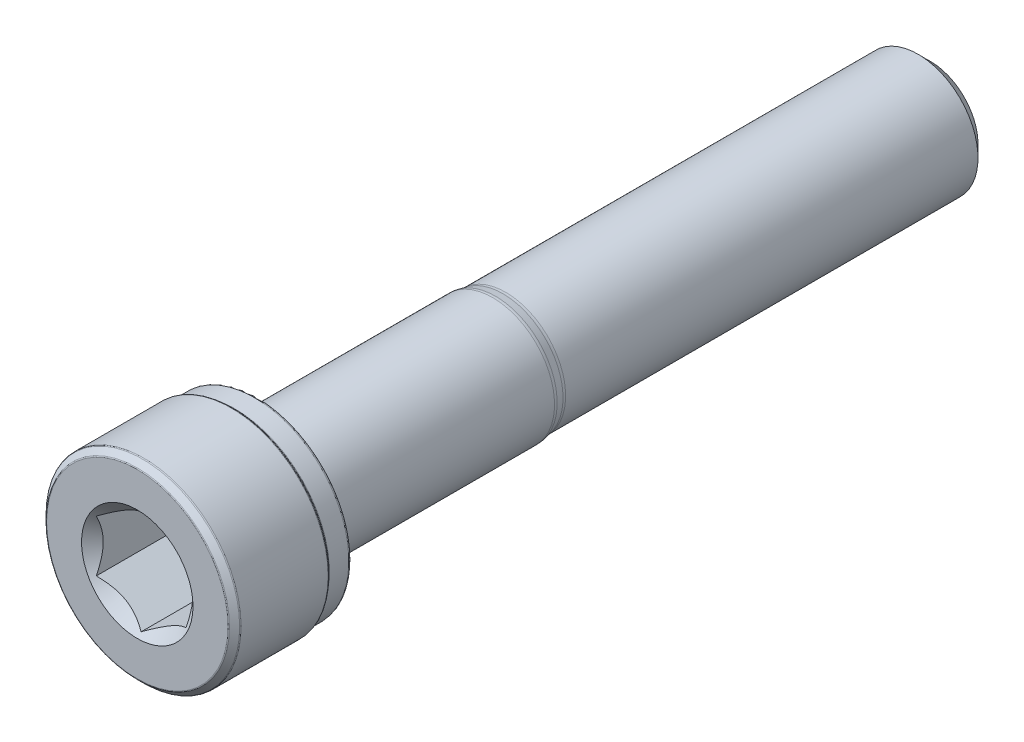
ISO-10303-21;
HEADER;
FILE_DESCRIPTION(('STEP AP214'),'2;1');
FILE_NAME('part.step','',(''),(''),'','','');
FILE_SCHEMA(('AUTOMOTIVE_DESIGN { 1 0 10303 214 1 1 1 1 }'));
ENDSEC;
DATA;
#1=APPLICATION_CONTEXT('core data for automotive mechanical design processes');
#2=APPLICATION_PROTOCOL_DEFINITION('international standard','automotive_design',2000,#1);
#3=PRODUCT_CONTEXT('',#1,'mechanical');
#4=PRODUCT('Part','Part','',(#3));
#5=PRODUCT_RELATED_PRODUCT_CATEGORY('part','',(#4));
#6=PRODUCT_DEFINITION_FORMATION('','',#4);
#7=PRODUCT_DEFINITION_CONTEXT('part definition',#1,'design');
#8=PRODUCT_DEFINITION('design','',#6,#7);
#9=PRODUCT_DEFINITION_SHAPE('','',#8);
#10=(LENGTH_UNIT() NAMED_UNIT(*) SI_UNIT(.MILLI.,.METRE.));
#11=(NAMED_UNIT(*) PLANE_ANGLE_UNIT() SI_UNIT($,.RADIAN.));
#12=(NAMED_UNIT(*) SI_UNIT($,.STERADIAN.) SOLID_ANGLE_UNIT());
#13=UNCERTAINTY_MEASURE_WITH_UNIT(LENGTH_MEASURE(1.E-05),#10,'distance_accuracy_value','');
#14=(GEOMETRIC_REPRESENTATION_CONTEXT(3) GLOBAL_UNCERTAINTY_ASSIGNED_CONTEXT((#13)) GLOBAL_UNIT_ASSIGNED_CONTEXT((#10,
#11,#12)) REPRESENTATION_CONTEXT('',''));
#15=CARTESIAN_POINT('',(0.,0.,0.));
#16=DIRECTION('',(0.,0.,1.));
#17=DIRECTION('',(1.,0.,0.));
#18=AXIS2_PLACEMENT_3D('',#15,#16,#17);
#19=CARTESIAN_POINT('',(0.,3.18810118395208,-26.5));
#20=DIRECTION('',(0.,0.,-1.));
#21=DIRECTION('',(-1.,0.,0.));
#22=AXIS2_PLACEMENT_3D('',#19,#20,#21);
#23=PLANE('',#22);
#24=CARTESIAN_POINT('',(0.,0.,-26.5));
#25=DIRECTION('',(0.,0.,-1.));
#26=DIRECTION('',(-1.,0.,0.));
#27=AXIS2_PLACEMENT_3D('',#24,#25,#26);
#28=CIRCLE('',#27,3.18810118395208);
#29=CARTESIAN_POINT('',(-3.18810118395208,0.,-26.5));
#30=VERTEX_POINT('',#29);
#31=EDGE_CURVE('E49',#30,#30,#28,.T.);
#32=ORIENTED_EDGE('',*,*,#31,.T.);
#33=EDGE_LOOP('',(#32));
#34=FACE_BOUND('',#33,.T.);
#35=ADVANCED_FACE('F36',(#34),#23,.T.);
#36=CARTESIAN_POINT('',(0.,0.,-26.5));
#37=DIRECTION('',(0.,0.,1.));
#38=DIRECTION('',(1.,0.,0.));
#39=AXIS2_PLACEMENT_3D('',#36,#37,#38);
#40=CONICAL_SURFACE('',#39,3.18810118395208,0.785398163397442);
#41=CARTESIAN_POINT('',(0.,0.,-25.6881011839521));
#42=DIRECTION('',(0.,0.,-1.));
#43=DIRECTION('',(-1.,0.,0.));
#44=AXIS2_PLACEMENT_3D('',#41,#42,#43);
#45=CIRCLE('',#44,4.);
#46=CARTESIAN_POINT('',(-4.,0.,-25.6881011839521));
#47=VERTEX_POINT('',#46);
#48=EDGE_CURVE('E182',#47,#47,#45,.T.);
#49=ORIENTED_EDGE('',*,*,#48,.T.);
#50=EDGE_LOOP('',(#49));
#51=FACE_BOUND('',#50,.T.);
#52=ORIENTED_EDGE('',*,*,#31,.F.);
#53=EDGE_LOOP('',(#52));
#54=FACE_BOUND('',#53,.T.);
#55=ADVANCED_FACE('F188',(#51,#54),#40,.T.);
#56=CARTESIAN_POINT('',(0.,0.,-26.5));
#57=DIRECTION('',(0.,0.,-1.));
#58=DIRECTION('',(-1.,0.,0.));
#59=AXIS2_PLACEMENT_3D('',#56,#57,#58);
#60=CYLINDRICAL_SURFACE('',#59,4.);
#61=CARTESIAN_POINT('',(0.,0.,1.87025859664283));
#62=DIRECTION('',(0.,0.,-1.));
#63=DIRECTION('',(-1.,0.,0.));
#64=AXIS2_PLACEMENT_3D('',#61,#62,#63);
#65=CIRCLE('',#64,4.);
#66=CARTESIAN_POINT('',(-4.,0.,1.87025859664283));
#67=VERTEX_POINT('',#66);
#68=EDGE_CURVE('E179',#67,#67,#65,.T.);
#69=ORIENTED_EDGE('',*,*,#68,.T.);
#70=EDGE_LOOP('',(#69));
#71=FACE_BOUND('',#70,.T.);
#72=ORIENTED_EDGE('',*,*,#48,.F.);
#73=EDGE_LOOP('',(#72));
#74=FACE_BOUND('',#73,.T.);
#75=ADVANCED_FACE('F190',(#71,#74),#60,.T.);
#76=CARTESIAN_POINT('',(0.,0.,1.87025859664283));
#77=DIRECTION('',(0.,0.,-1.));
#78=DIRECTION('',(-1.,0.,0.));
#79=AXIS2_PLACEMENT_3D('',#76,#77,#78);
#80=TOROIDAL_SURFACE('',#79,5.,1.);
#81=CARTESIAN_POINT('',(0.,0.,2.06534891865896));
#82=DIRECTION('',(0.,0.,-1.));
#83=DIRECTION('',(-1.,0.,0.));
#84=AXIS2_PLACEMENT_3D('',#81,#82,#83);
#85=CIRCLE('',#84,4.01921471959677);
#86=CARTESIAN_POINT('',(-4.01921471959677,0.,2.06534891865896));
#87=VERTEX_POINT('',#86);
#88=EDGE_CURVE('E176',#87,#87,#85,.T.);
#89=ORIENTED_EDGE('',*,*,#88,.T.);
#90=EDGE_LOOP('',(#89));
#91=FACE_BOUND('',#90,.T.);
#92=ORIENTED_EDGE('',*,*,#68,.F.);
#93=EDGE_LOOP('',(#92));
#94=FACE_BOUND('',#93,.T.);
#95=ADVANCED_FACE('F196',(#91,#94),#80,.F.);
#96=CARTESIAN_POINT('',(0.,0.,2.06534891865896));
#97=DIRECTION('',(0.,0.,1.));
#98=DIRECTION('',(1.,0.,0.));
#99=AXIS2_PLACEMENT_3D('',#96,#97,#98);
#100=CONICAL_SURFACE('',#99,4.01921471959677,0.196349540849363);
#101=CARTESIAN_POINT('',(0.,0.,2.55243291159565));
#102=DIRECTION('',(0.,0.,-1.));
#103=DIRECTION('',(-1.,0.,0.));
#104=AXIS2_PLACEMENT_3D('',#101,#102,#103);
#105=CIRCLE('',#104,4.11610174974455);
#106=CARTESIAN_POINT('',(-4.11610174974455,0.,2.55243291159565));
#107=VERTEX_POINT('',#106);
#108=EDGE_CURVE('E173',#107,#107,#105,.T.);
#109=ORIENTED_EDGE('',*,*,#108,.T.);
#110=EDGE_LOOP('',(#109));
#111=FACE_BOUND('',#110,.T.);
#112=ORIENTED_EDGE('',*,*,#88,.F.);
#113=EDGE_LOOP('',(#112));
#114=FACE_BOUND('',#113,.T.);
#115=ADVANCED_FACE('F202',(#111,#114),#100,.T.);
#116=CARTESIAN_POINT('',(0.,0.,2.74752323361178));
#117=DIRECTION('',(0.,0.,-1.));
#118=DIRECTION('',(-1.,0.,0.));
#119=AXIS2_PLACEMENT_3D('',#116,#117,#118);
#120=TOROIDAL_SURFACE('',#119,3.13531646934131,1.);
#121=CARTESIAN_POINT('',(0.,0.,2.74752323361178));
#122=DIRECTION('',(0.,0.,-1.));
#123=DIRECTION('',(-1.,0.,0.));
#124=AXIS2_PLACEMENT_3D('',#121,#122,#123);
#125=CIRCLE('',#124,4.13531646934131);
#126=CARTESIAN_POINT('',(-4.13531646934131,0.,2.74752323361178));
#127=VERTEX_POINT('',#126);
#128=EDGE_CURVE('E170',#127,#127,#125,.T.);
#129=ORIENTED_EDGE('',*,*,#128,.T.);
#130=EDGE_LOOP('',(#129));
#131=FACE_BOUND('',#130,.T.);
#132=ORIENTED_EDGE('',*,*,#108,.F.);
#133=EDGE_LOOP('',(#132));
#134=FACE_BOUND('',#133,.T.);
#135=ADVANCED_FACE('F206',(#131,#134),#120,.T.);
#136=CARTESIAN_POINT('',(0.,0.,-26.5));
#137=DIRECTION('',(0.,0.,-1.));
#138=DIRECTION('',(-1.,0.,0.));
#139=AXIS2_PLACEMENT_3D('',#136,#137,#138);
#140=CYLINDRICAL_SURFACE('',#139,4.13531646934131);
#141=CARTESIAN_POINT('',(0.,0.,18.1));
#142=DIRECTION('',(0.,0.,-1.));
#143=DIRECTION('',(-1.,0.,0.));
#144=AXIS2_PLACEMENT_3D('',#141,#142,#143);
#145=CIRCLE('',#144,4.13531646934132);
#146=CARTESIAN_POINT('',(-4.13531646934132,0.,18.1));
#147=VERTEX_POINT('',#146);
#148=EDGE_CURVE('E167',#147,#147,#145,.T.);
#149=ORIENTED_EDGE('',*,*,#148,.T.);
#150=EDGE_LOOP('',(#149));
#151=FACE_BOUND('',#150,.T.);
#152=ORIENTED_EDGE('',*,*,#128,.F.);
#153=EDGE_LOOP('',(#152));
#154=FACE_BOUND('',#153,.T.);
#155=ADVANCED_FACE('F210',(#151,#154),#140,.T.);
#156=CARTESIAN_POINT('',(0.,0.,18.1));
#157=DIRECTION('',(0.,0.,-1.));
#158=DIRECTION('',(-1.,0.,0.));
#159=AXIS2_PLACEMENT_3D('',#156,#157,#158);
#160=TOROIDAL_SURFACE('',#159,4.53531646934131,0.399999999999999);
#161=CARTESIAN_POINT('',(0.,0.,18.5));
#162=DIRECTION('',(0.,0.,-1.));
#163=DIRECTION('',(-1.,0.,0.));
#164=AXIS2_PLACEMENT_3D('',#161,#162,#163);
#165=CIRCLE('',#164,4.53531646934131);
#166=CARTESIAN_POINT('',(-4.53531646934131,0.,18.5));
#167=VERTEX_POINT('',#166);
#168=EDGE_CURVE('E164',#167,#167,#165,.T.);
#169=ORIENTED_EDGE('',*,*,#168,.T.);
#170=EDGE_LOOP('',(#169));
#171=FACE_BOUND('',#170,.T.);
#172=ORIENTED_EDGE('',*,*,#148,.F.);
#173=EDGE_LOOP('',(#172));
#174=FACE_BOUND('',#173,.T.);
#175=ADVANCED_FACE('F214',(#171,#174),#160,.F.);
#176=CARTESIAN_POINT('',(0.,6.1375,18.5));
#177=DIRECTION('',(0.,0.,-1.));
#178=DIRECTION('',(-1.,0.,0.));
#179=AXIS2_PLACEMENT_3D('',#176,#177,#178);
#180=PLANE('',#179);
#181=CARTESIAN_POINT('',(0.,0.,18.5));
#182=DIRECTION('',(0.,0.,-1.));
#183=DIRECTION('',(-1.,0.,0.));
#184=AXIS2_PLACEMENT_3D('',#181,#182,#183);
#185=CIRCLE('',#184,6.1375);
#186=CARTESIAN_POINT('',(-6.1375,0.,18.5));
#187=VERTEX_POINT('',#186);
#188=EDGE_CURVE('E161',#187,#187,#185,.T.);
#189=ORIENTED_EDGE('',*,*,#188,.T.);
#190=EDGE_LOOP('',(#189));
#191=FACE_BOUND('',#190,.T.);
#192=ORIENTED_EDGE('',*,*,#168,.F.);
#193=EDGE_LOOP('',(#192));
#194=FACE_BOUND('',#193,.T.);
#195=ADVANCED_FACE('F218',(#191,#194),#180,.T.);
#196=CARTESIAN_POINT('',(0.,0.,18.6625));
#197=DIRECTION('',(0.,0.,-1.));
#198=DIRECTION('',(-1.,0.,0.));
#199=AXIS2_PLACEMENT_3D('',#196,#197,#198);
#200=TOROIDAL_SURFACE('',#199,6.1375,0.1625);
#201=CARTESIAN_POINT('',(0.,0.,18.6625));
#202=DIRECTION('',(0.,0.,-1.));
#203=DIRECTION('',(-1.,0.,0.));
#204=AXIS2_PLACEMENT_3D('',#201,#202,#203);
#205=CIRCLE('',#204,6.3);
#206=CARTESIAN_POINT('',(-6.3,0.,18.6625));
#207=VERTEX_POINT('',#206);
#208=EDGE_CURVE('E158',#207,#207,#205,.T.);
#209=ORIENTED_EDGE('',*,*,#208,.T.);
#210=EDGE_LOOP('',(#209));
#211=FACE_BOUND('',#210,.T.);
#212=ORIENTED_EDGE('',*,*,#188,.F.);
#213=EDGE_LOOP('',(#212));
#214=FACE_BOUND('',#213,.T.);
#215=ADVANCED_FACE('F222',(#211,#214),#200,.T.);
#216=CARTESIAN_POINT('',(0.,0.,-26.5));
#217=DIRECTION('',(0.,0.,-1.));
#218=DIRECTION('',(-1.,0.,0.));
#219=AXIS2_PLACEMENT_3D('',#216,#217,#218);
#220=CYLINDRICAL_SURFACE('',#219,6.3);
#221=CARTESIAN_POINT('',(0.,0.,19.9585786437627));
#222=DIRECTION('',(0.,0.,-1.));
#223=DIRECTION('',(-1.,0.,0.));
#224=AXIS2_PLACEMENT_3D('',#221,#222,#223);
#225=CIRCLE('',#224,6.3);
#226=CARTESIAN_POINT('',(-6.3,0.,19.9585786437627));
#227=VERTEX_POINT('',#226);
#228=EDGE_CURVE('E155',#227,#227,#225,.T.);
#229=ORIENTED_EDGE('',*,*,#228,.T.);
#230=EDGE_LOOP('',(#229));
#231=FACE_BOUND('',#230,.T.);
#232=ORIENTED_EDGE('',*,*,#208,.F.);
#233=EDGE_LOOP('',(#232));
#234=FACE_BOUND('',#233,.T.);
#235=ADVANCED_FACE('F226',(#231,#234),#220,.T.);
#236=CARTESIAN_POINT('',(0.,0.,19.9585786437627));
#237=DIRECTION('',(0.,0.,-1.));
#238=DIRECTION('',(-1.,0.,0.));
#239=AXIS2_PLACEMENT_3D('',#236,#237,#238);
#240=TOROIDAL_SURFACE('',#239,6.4,0.0999999999999996);
#241=CARTESIAN_POINT('',(0.,0.,20.0292893218813));
#242=DIRECTION('',(0.,0.,-1.));
#243=DIRECTION('',(-1.,0.,0.));
#244=AXIS2_PLACEMENT_3D('',#241,#242,#243);
#245=CIRCLE('',#244,6.32928932188134);
#246=CARTESIAN_POINT('',(-6.32928932188134,0.,20.0292893218813));
#247=VERTEX_POINT('',#246);
#248=EDGE_CURVE('E152',#247,#247,#245,.T.);
#249=ORIENTED_EDGE('',*,*,#248,.T.);
#250=EDGE_LOOP('',(#249));
#251=FACE_BOUND('',#250,.T.);
#252=ORIENTED_EDGE('',*,*,#228,.F.);
#253=EDGE_LOOP('',(#252));
#254=FACE_BOUND('',#253,.T.);
#255=ADVANCED_FACE('F230',(#251,#254),#240,.F.);
#256=CARTESIAN_POINT('',(0.,0.,20.0292893218813));
#257=DIRECTION('',(0.,0.,1.));
#258=DIRECTION('',(1.,0.,0.));
#259=AXIS2_PLACEMENT_3D('',#256,#257,#258);
#260=CONICAL_SURFACE('',#259,6.32928932188134,0.785398163397436);
#261=CARTESIAN_POINT('',(0.,0.,20.1707106781187));
#262=DIRECTION('',(0.,0.,-1.));
#263=DIRECTION('',(-1.,0.,0.));
#264=AXIS2_PLACEMENT_3D('',#261,#262,#263);
#265=CIRCLE('',#264,6.47071067811865);
#266=CARTESIAN_POINT('',(-6.47071067811865,0.,20.1707106781187));
#267=VERTEX_POINT('',#266);
#268=EDGE_CURVE('E149',#267,#267,#265,.T.);
#269=ORIENTED_EDGE('',*,*,#268,.T.);
#270=EDGE_LOOP('',(#269));
#271=FACE_BOUND('',#270,.T.);
#272=ORIENTED_EDGE('',*,*,#248,.F.);
#273=EDGE_LOOP('',(#272));
#274=FACE_BOUND('',#273,.T.);
#275=ADVANCED_FACE('F234',(#271,#274),#260,.T.);
#276=CARTESIAN_POINT('',(0.,0.,20.2414213562373));
#277=DIRECTION('',(0.,0.,-1.));
#278=DIRECTION('',(-1.,0.,0.));
#279=AXIS2_PLACEMENT_3D('',#276,#277,#278);
#280=TOROIDAL_SURFACE('',#279,6.4,0.100000000000001);
#281=CARTESIAN_POINT('',(0.,0.,20.2414213562373));
#282=DIRECTION('',(0.,0.,-1.));
#283=DIRECTION('',(-1.,0.,0.));
#284=AXIS2_PLACEMENT_3D('',#281,#282,#283);
#285=CIRCLE('',#284,6.5);
#286=CARTESIAN_POINT('',(-6.5,0.,20.2414213562373));
#287=VERTEX_POINT('',#286);
#288=EDGE_CURVE('E146',#287,#287,#285,.T.);
#289=ORIENTED_EDGE('',*,*,#288,.T.);
#290=EDGE_LOOP('',(#289));
#291=FACE_BOUND('',#290,.T.);
#292=ORIENTED_EDGE('',*,*,#268,.F.);
#293=EDGE_LOOP('',(#292));
#294=FACE_BOUND('',#293,.T.);
#295=ADVANCED_FACE('F238',(#291,#294),#280,.T.);
#296=CARTESIAN_POINT('',(0.,0.,-26.5));
#297=DIRECTION('',(0.,0.,-1.));
#298=DIRECTION('',(-1.,0.,0.));
#299=AXIS2_PLACEMENT_3D('',#296,#297,#298);
#300=CYLINDRICAL_SURFACE('',#299,6.5);
#301=CARTESIAN_POINT('',(0.,0.,26.0585786437627));
#302=DIRECTION('',(0.,0.,-1.));
#303=DIRECTION('',(-1.,0.,0.));
#304=AXIS2_PLACEMENT_3D('',#301,#302,#303);
#305=CIRCLE('',#304,6.5);
#306=CARTESIAN_POINT('',(-6.5,0.,26.0585786437627));
#307=VERTEX_POINT('',#306);
#308=EDGE_CURVE('E143',#307,#307,#305,.T.);
#309=ORIENTED_EDGE('',*,*,#308,.T.);
#310=EDGE_LOOP('',(#309));
#311=FACE_BOUND('',#310,.T.);
#312=ORIENTED_EDGE('',*,*,#288,.F.);
#313=EDGE_LOOP('',(#312));
#314=FACE_BOUND('',#313,.T.);
#315=ADVANCED_FACE('F242',(#311,#314),#300,.T.);
#316=CARTESIAN_POINT('',(0.,0.,26.0585786437627));
#317=DIRECTION('',(0.,0.,-1.));
#318=DIRECTION('',(-1.,0.,0.));
#319=AXIS2_PLACEMENT_3D('',#316,#317,#318);
#320=TOROIDAL_SURFACE('',#319,6.4,0.0999999999999985);
#321=CARTESIAN_POINT('',(0.,0.,26.1292893218813));
#322=DIRECTION('',(0.,0.,-1.));
#323=DIRECTION('',(-1.,0.,0.));
#324=AXIS2_PLACEMENT_3D('',#321,#322,#323);
#325=CIRCLE('',#324,6.47071067811865);
#326=CARTESIAN_POINT('',(-6.47071067811865,0.,26.1292893218813));
#327=VERTEX_POINT('',#326);
#328=EDGE_CURVE('E140',#327,#327,#325,.T.);
#329=ORIENTED_EDGE('',*,*,#328,.T.);
#330=EDGE_LOOP('',(#329));
#331=FACE_BOUND('',#330,.T.);
#332=ORIENTED_EDGE('',*,*,#308,.F.);
#333=EDGE_LOOP('',(#332));
#334=FACE_BOUND('',#333,.T.);
#335=ADVANCED_FACE('F246',(#331,#334),#320,.T.);
#336=CARTESIAN_POINT('',(0.,0.,26.1292893218813));
#337=DIRECTION('',(0.,0.,-1.));
#338=DIRECTION('',(-1.,0.,0.));
#339=AXIS2_PLACEMENT_3D('',#336,#337,#338);
#340=CONICAL_SURFACE('',#339,6.47071067811865,0.785398163397448);
#341=CARTESIAN_POINT('',(0.,0.,26.4707106781186));
#342=DIRECTION('',(0.,0.,-1.));
#343=DIRECTION('',(-1.,0.,0.));
#344=AXIS2_PLACEMENT_3D('',#341,#342,#343);
#345=CIRCLE('',#344,6.12928932188134);
#346=CARTESIAN_POINT('',(-6.12928932188134,0.,26.4707106781186));
#347=VERTEX_POINT('',#346);
#348=EDGE_CURVE('E137',#347,#347,#345,.T.);
#349=ORIENTED_EDGE('',*,*,#348,.T.);
#350=EDGE_LOOP('',(#349));
#351=FACE_BOUND('',#350,.T.);
#352=ORIENTED_EDGE('',*,*,#328,.F.);
#353=EDGE_LOOP('',(#352));
#354=FACE_BOUND('',#353,.T.);
#355=ADVANCED_FACE('F250',(#351,#354),#340,.T.);
#356=CARTESIAN_POINT('',(0.,0.,26.4));
#357=DIRECTION('',(0.,0.,-1.));
#358=DIRECTION('',(-1.,0.,0.));
#359=AXIS2_PLACEMENT_3D('',#356,#357,#358);
#360=TOROIDAL_SURFACE('',#359,6.05857864376269,0.0999999999999962);
#361=CARTESIAN_POINT('',(0.,0.,26.5));
#362=DIRECTION('',(0.,0.,-1.));
#363=DIRECTION('',(-1.,0.,0.));
#364=AXIS2_PLACEMENT_3D('',#361,#362,#363);
#365=CIRCLE('',#364,6.05857864376269);
#366=CARTESIAN_POINT('',(-6.05857864376269,0.,26.5));
#367=VERTEX_POINT('',#366);
#368=EDGE_CURVE('E134',#367,#367,#365,.T.);
#369=ORIENTED_EDGE('',*,*,#368,.T.);
#370=EDGE_LOOP('',(#369));
#371=FACE_BOUND('',#370,.T.);
#372=ORIENTED_EDGE('',*,*,#348,.F.);
#373=EDGE_LOOP('',(#372));
#374=FACE_BOUND('',#373,.T.);
#375=ADVANCED_FACE('F254',(#371,#374),#360,.T.);
#376=CARTESIAN_POINT('',(0.,0.,26.5));
#377=DIRECTION('',(0.,0.,1.));
#378=DIRECTION('',(1.,0.,0.));
#379=AXIS2_PLACEMENT_3D('',#376,#377,#378);
#380=PLANE('',#379);
#381=CARTESIAN_POINT('',(0.,0.,26.5));
#382=DIRECTION('',(0.,0.,1.));
#383=DIRECTION('',(1.,0.,0.));
#384=AXIS2_PLACEMENT_3D('',#381,#382,#383);
#385=CIRCLE('',#384,3.72390923627308);
#386=CARTESIAN_POINT('',(3.72390923627308,0.,26.5));
#387=VERTEX_POINT('',#386);
#388=EDGE_CURVE('E108',#387,#387,#385,.T.);
#389=ORIENTED_EDGE('',*,*,#388,.F.);
#390=EDGE_LOOP('',(#389));
#391=FACE_BOUND('',#390,.T.);
#392=ORIENTED_EDGE('',*,*,#368,.F.);
#393=EDGE_LOOP('',(#392));
#394=FACE_BOUND('',#393,.T.);
#395=ADVANCED_FACE('F258',(#391,#394),#380,.T.);
#396=CARTESIAN_POINT('',(0.,0.,26.5));
#397=DIRECTION('',(0.,0.,1.));
#398=DIRECTION('',(1.,0.,0.));
#399=AXIS2_PLACEMENT_3D('',#396,#397,#398);
#400=CONICAL_SURFACE('',#399,3.72390923627308,0.78539816339745);
#401=ORIENTED_EDGE('',*,*,#388,.T.);
#402=EDGE_LOOP('',(#401));
#403=FACE_BOUND('',#402,.T.);
#404=CARTESIAN_POINT('',(-0.000199999999999184,-3.46421708519159,26.2403078546918));
#405=CARTESIAN_POINT('',(0.102923514955749,-3.40467869607211,26.1808206971865));
#406=CARTESIAN_POINT('',(0.207771389330652,-3.3441447475778,26.1248273583302));
#407=CARTESIAN_POINT('',(0.421567671781098,-3.22070940635329,26.0223049752436));
#408=CARTESIAN_POINT('',(0.530536411379761,-3.15779627521275,25.975832972606));
#409=CARTESIAN_POINT('',(0.75026663959703,-3.03093496880241,25.896225567381));
#410=CARTESIAN_POINT('',(0.860972171762213,-2.96701910000606,25.8628900795073));
#411=CARTESIAN_POINT('',(1.08482041056533,-2.83778025907546,25.811529922844));
#412=CARTESIAN_POINT('',(1.19795627920699,-2.77246123486019,25.7934669164003));
#413=CARTESIAN_POINT('',(1.3929409561927,-2.65988677911464,25.7771692873152));
#414=CARTESIAN_POINT('',(1.47453795400213,-2.6127767304643,25.7747567460385));
#415=CARTESIAN_POINT('',(1.63759922883009,-2.51863325954797,25.7788218135218));
#416=CARTESIAN_POINT('',(1.71906344929899,-2.47159986993093,25.785302538893));
#417=CARTESIAN_POINT('',(1.88122011233837,-2.37797867687425,25.8067841013799));
#418=CARTESIAN_POINT('',(1.9619115887843,-2.33139143122689,25.8217944688319));
#419=CARTESIAN_POINT('',(2.12190869789133,-2.23901705721438,25.8595160249307));
#420=CARTESIAN_POINT('',(2.2012144363093,-2.19322986779049,25.8822266231875));
#421=CARTESIAN_POINT('',(2.34200614080275,-2.11194373930152,25.9289530637186));
#422=CARTESIAN_POINT('',(2.40380372214602,-2.07626488907772,25.9517407065455));
#423=CARTESIAN_POINT('',(2.52628941752022,-2.00554773988155,26.0009886649221));
#424=CARTESIAN_POINT('',(2.5869774976356,-1.97050946049033,26.0274490925309));
#425=CARTESIAN_POINT('',(2.70705299739086,-1.90118383838355,26.083449373256));
#426=CARTESIAN_POINT('',(2.76644383229592,-1.86689452386372,26.112979543343));
#427=CARTESIAN_POINT('',(2.88412556146727,-1.79895094584794,26.1747314704402));
#428=CARTESIAN_POINT('',(2.94241710424773,-1.76529630793216,26.206951575524));
#429=CARTESIAN_POINT('',(3.0002,-1.73193533751503,26.2403078546918));
#430=B_SPLINE_CURVE_WITH_KNOTS('',3,(#404,#405,#406,#407,#408,#409,#410,#411,#412,#413,#414,
#415,#416,#417,#418,#419,#420,#421,#422,#423,#424,#425,#426,#427,#428,#429),.UNSPECIFIED.,.F.,
.F.,(4,2,2,2,2,2,2,2,2,2,2,2,4),(0.,0.399603557139309,0.801535286397847,1.19708369162343,
1.59163620080173,1.87398941755844,2.15644160919093,2.43921001247425,2.72195674032138,
2.94657516661927,3.17120044767274,3.3951375283781,3.61893808380739),.UNSPECIFIED.);
#431=CARTESIAN_POINT('',(0.,-3.46410161513775,26.2401923788647));
#432=VERTEX_POINT('',#431);
#433=CARTESIAN_POINT('',(3.,-1.73205080756887,26.2401923788647));
#434=VERTEX_POINT('',#433);
#435=EDGE_CURVE('E13',#432,#434,#430,.T.);
#436=ORIENTED_EDGE('',*,*,#435,.F.);
#437=CARTESIAN_POINT('',(-3.0002,-1.73193533751504,26.2403078546918));
#438=CARTESIAN_POINT('',(-2.89707648504425,-1.79147372663452,26.1808206971865));
#439=CARTESIAN_POINT('',(-2.79222861066935,-1.85200767512883,26.1248273583302));
#440=CARTESIAN_POINT('',(-2.5784323282189,-1.97544301635333,26.0223049752436));
#441=CARTESIAN_POINT('',(-2.46946358862024,-2.03835614749388,25.975832972606));
#442=CARTESIAN_POINT('',(-2.24973336040297,-2.16521745390422,25.896225567381));
#443=CARTESIAN_POINT('',(-2.13902782823779,-2.22913332270056,25.8628900795073));
#444=CARTESIAN_POINT('',(-1.91517958943467,-2.35837216363117,25.811529922844));
#445=CARTESIAN_POINT('',(-1.802043720793,-2.42369118784643,25.7934669164003));
#446=CARTESIAN_POINT('',(-1.6070590438073,-2.53626564359199,25.7771692873152));
#447=CARTESIAN_POINT('',(-1.52546204599786,-2.58337569224233,25.7747567460385));
#448=CARTESIAN_POINT('',(-1.36240077116991,-2.67751916315865,25.7788218135218));
#449=CARTESIAN_POINT('',(-1.28093655070101,-2.72455255277569,25.785302538893));
#450=CARTESIAN_POINT('',(-1.11877988766163,-2.81817374583237,25.8067841013799));
#451=CARTESIAN_POINT('',(-1.0380884112157,-2.86476099147974,25.8217944688319));
#452=CARTESIAN_POINT('',(-0.878091302108663,-2.95713536549224,25.8595160249307));
#453=CARTESIAN_POINT('',(-0.798785563690702,-3.00292255491614,25.8822266231875));
#454=CARTESIAN_POINT('',(-0.657993859197245,-3.0842086834051,25.9289530637186));
#455=CARTESIAN_POINT('',(-0.596196277853972,-3.11988753362891,25.9517407065455));
#456=CARTESIAN_POINT('',(-0.473710582479778,-3.19060468282508,26.0009886649221));
#457=CARTESIAN_POINT('',(-0.413022502364395,-3.22564296221629,26.0274490925309));
#458=CARTESIAN_POINT('',(-0.292947002609135,-3.29496858432307,26.083449373256));
#459=CARTESIAN_POINT('',(-0.23355616770408,-3.3292578988429,26.112979543343));
#460=CARTESIAN_POINT('',(-0.11587443853273,-3.39720147685868,26.1747314704402));
#461=CARTESIAN_POINT('',(-0.0575828957522639,-3.43085611477446,26.206951575524));
#462=CARTESIAN_POINT('',(0.000200000000001582,-3.46421708519159,26.2403078546918));
#463=B_SPLINE_CURVE_WITH_KNOTS('',3,(#437,#438,#439,#440,#441,#442,#443,#444,#445,#446,#447,
#448,#449,#450,#451,#452,#453,#454,#455,#456,#457,#458,#459,#460,#461,#462),.UNSPECIFIED.,.F.,
.F.,(4,2,2,2,2,2,2,2,2,2,2,2,4),(0.,0.399603557139306,0.801535286397845,1.19708369162343,
1.59163620080173,1.87398941755844,2.15644160919093,2.43921001247425,2.72195674032138,
2.94657516661926,3.17120044767274,3.3951375283781,3.61893808380739),.UNSPECIFIED.);
#464=CARTESIAN_POINT('',(-3.,-1.73205080756887,26.2401923788647));
#465=VERTEX_POINT('',#464);
#466=EDGE_CURVE('E94',#465,#432,#463,.T.);
#467=ORIENTED_EDGE('',*,*,#466,.F.);
#468=CARTESIAN_POINT('',(-3.,-3.63597263369801,27.4899317658186));
#469=CARTESIAN_POINT('',(-3.,-3.54821081453762,27.4222527639653));
#470=CARTESIAN_POINT('',(-3.,-3.45997854995776,27.3551742635189));
#471=CARTESIAN_POINT('',(-3.,-3.28237997949551,27.2224933181335));
#472=CARTESIAN_POINT('',(-3.,-3.19301341225036,27.1568912234072));
#473=CARTESIAN_POINT('',(-3.,-3.01230028902465,27.026971369594));
#474=CARTESIAN_POINT('',(-3.,-2.92094378054021,26.962667408983));
#475=CARTESIAN_POINT('',(-3.,-2.73671453430276,26.8362769746898));
#476=CARTESIAN_POINT('',(-3.,-2.64384190127937,26.774190348777));
#477=CARTESIAN_POINT('',(-3.,-2.45029951749767,26.6488396249979));
#478=CARTESIAN_POINT('',(-3.,-2.34951218319449,26.5857561674871));
#479=CARTESIAN_POINT('',(-3.,-2.14556933396837,26.4634753027544));
#480=CARTESIAN_POINT('',(-3.,-2.04241342144356,26.4042785545085));
#481=CARTESIAN_POINT('',(-3.,-1.83370026413672,26.2910295461651));
#482=CARTESIAN_POINT('',(-3.,-1.72815127460949,26.2369621909277));
#483=CARTESIAN_POINT('',(-3.,-1.51405629629858,26.135183407377));
#484=CARTESIAN_POINT('',(-3.,-1.40551175824851,26.0874689653898));
#485=CARTESIAN_POINT('',(-3.,-1.1962992758153,26.0045378495382));
#486=CARTESIAN_POINT('',(-3.,-1.09594180146237,25.9685458924784));
#487=CARTESIAN_POINT('',(-3.,-0.892651828129795,25.9045932060893));
#488=CARTESIAN_POINT('',(-3.,-0.789719167141593,25.8766329834357));
#489=CARTESIAN_POINT('',(-3.,-0.583697290901956,25.8307307883211));
#490=CARTESIAN_POINT('',(-3.,-0.480649626339328,25.8126054725429));
#491=CARTESIAN_POINT('',(-3.,-0.273250769977056,25.7867543887193));
#492=CARTESIAN_POINT('',(-3.,-0.168899860014967,25.7790264101634));
#493=CARTESIAN_POINT('',(-3.,0.0353613814991981,25.7746391860521));
#494=CARTESIAN_POINT('',(-3.,0.135261478415164,25.7775001300684));
#495=CARTESIAN_POINT('',(-3.,0.334290885877441,25.7930266368826));
#496=CARTESIAN_POINT('',(-3.,0.433420126307057,25.8056930812866));
#497=CARTESIAN_POINT('',(-3.,0.631874596080604,25.8403254397116));
#498=CARTESIAN_POINT('',(-3.,0.731170585274612,25.8624563348122));
#499=CARTESIAN_POINT('',(-3.,0.927562094571362,25.9147869672083));
#500=CARTESIAN_POINT('',(-3.,1.02465773123986,25.9449862759829));
#501=CARTESIAN_POINT('',(-3.,1.32263484371317,26.0492279624378));
#502=CARTESIAN_POINT('',(-3.,1.51949127420347,26.1348113474384));
#503=CARTESIAN_POINT('',(-3.,1.80760742350502,26.277589656377));
#504=CARTESIAN_POINT('',(-3.,1.90262753095824,26.3276934985151));
#505=CARTESIAN_POINT('',(-3.,2.09051797246354,26.4317906459646));
#506=CARTESIAN_POINT('',(-3.,2.18338867977823,26.4857832691553));
#507=CARTESIAN_POINT('',(-3.,2.36269431772654,26.5941374400834));
#508=CARTESIAN_POINT('',(-3.,2.44922070423858,26.6483493485577));
#509=CARTESIAN_POINT('',(-3.,2.62078869979529,26.7590849027924));
#510=CARTESIAN_POINT('',(-3.,2.70583019698247,26.8156087216473));
#511=CARTESIAN_POINT('',(-3.,2.87393748584988,26.9300950802763));
#512=CARTESIAN_POINT('',(-3.,2.95701365163953,26.9880424502656));
#513=CARTESIAN_POINT('',(-3.,3.12202586462518,27.1054926827478));
#514=CARTESIAN_POINT('',(-3.,3.20396221984363,27.1649951119776));
#515=CARTESIAN_POINT('',(-3.,3.28542059434172,27.2251343105721));
#516=B_SPLINE_CURVE_WITH_KNOTS('',3,(#468,#469,#470,#471,#472,#473,#474,#475,#476,#477,#478,
#479,#480,#481,#482,#483,#484,#485,#486,#487,#488,#489,#490,#491,#492,#493,#494,#495,#496,#497,
#498,#499,#500,#501,#502,#503,#504,#505,#506,#507,#508,#509,#510,#511,#512,#513,#514,#515),
.UNSPECIFIED.,.F.,.F.,(4,2,2,2,2,2,2,2,2,2,2,2,2,2,2,2,2,2,2,2,2,2,2,4),(0.,0.332486500650509,
0.665051055190987,1.00017918858508,1.33528426941216,1.69191962778576,2.04861529694579,
2.40422638996116,2.75966818372677,3.07924217570899,3.39883632334218,3.71224778650697,
4.02559260675559,4.32491644245469,4.62426719328911,4.92906363386979,5.23384388964463,
5.87582449637266,6.19805908905046,6.52023729642129,6.82651951595852,7.13282470921206,
7.4366739083973,7.74043933457839),.UNSPECIFIED.);
#517=CARTESIAN_POINT('',(-3.,1.73205080756887,26.2401923788647));
#518=VERTEX_POINT('',#517);
#519=EDGE_CURVE('E107',#518,#465,#516,.F.);
#520=ORIENTED_EDGE('',*,*,#519,.F.);
#521=CARTESIAN_POINT('',(0.000200000000000802,3.46421708519159,26.2403078546918));
#522=CARTESIAN_POINT('',(-0.102923514955749,3.40467869607211,26.1808206971865));
#523=CARTESIAN_POINT('',(-0.207771389330651,3.3441447475778,26.1248273583302));
#524=CARTESIAN_POINT('',(-0.421567671781098,3.22070940635329,26.0223049752436));
#525=CARTESIAN_POINT('',(-0.530536411379762,3.15779627521275,25.975832972606));
#526=CARTESIAN_POINT('',(-0.750266639597032,3.03093496880241,25.896225567381));
#527=CARTESIAN_POINT('',(-0.860972171762215,2.96701910000606,25.8628900795073));
#528=CARTESIAN_POINT('',(-1.08482041056533,2.83778025907546,25.811529922844));
#529=CARTESIAN_POINT('',(-1.197956279207,2.77246123486019,25.7934669164003));
#530=CARTESIAN_POINT('',(-1.39294095619271,2.65988677911464,25.7771692873152));
#531=CARTESIAN_POINT('',(-1.47453795400214,2.6127767304643,25.7747567460385));
#532=CARTESIAN_POINT('',(-1.63759922883009,2.51863325954797,25.7788218135218));
#533=CARTESIAN_POINT('',(-1.71906344929899,2.47159986993093,25.785302538893));
#534=CARTESIAN_POINT('',(-1.88122011233837,2.37797867687425,25.8067841013799));
#535=CARTESIAN_POINT('',(-1.96191158878431,2.33139143122688,25.8217944688319));
#536=CARTESIAN_POINT('',(-2.12190869789134,2.23901705721438,25.8595160249307));
#537=CARTESIAN_POINT('',(-2.2012144363093,2.19322986779048,25.8822266231875));
#538=CARTESIAN_POINT('',(-2.34200614080276,2.11194373930152,25.9289530637186));
#539=CARTESIAN_POINT('',(-2.40380372214603,2.07626488907772,25.9517407065455));
#540=CARTESIAN_POINT('',(-2.52628941752022,2.00554773988155,26.0009886649221));
#541=CARTESIAN_POINT('',(-2.58697749763561,1.97050946049033,26.0274490925309));
#542=CARTESIAN_POINT('',(-2.70705299739086,1.90118383838355,26.083449373256));
#543=CARTESIAN_POINT('',(-2.76644383229592,1.86689452386372,26.112979543343));
#544=CARTESIAN_POINT('',(-2.88412556146727,1.79895094584794,26.1747314704402));
#545=CARTESIAN_POINT('',(-2.94241710424773,1.76529630793216,26.206951575524));
#546=CARTESIAN_POINT('',(-3.0002,1.73193533751504,26.2403078546918));
#547=B_SPLINE_CURVE_WITH_KNOTS('',3,(#521,#522,#523,#524,#525,#526,#527,#528,#529,#530,#531,
#532,#533,#534,#535,#536,#537,#538,#539,#540,#541,#542,#543,#544,#545,#546),.UNSPECIFIED.,.F.,
.F.,(4,2,2,2,2,2,2,2,2,2,2,2,4),(0.,0.399603557139309,0.80153528639785,1.19708369162343,
1.59163620080174,1.87398941755845,2.15644160919093,2.43921001247426,2.72195674032139,
2.94657516661927,3.17120044767275,3.3951375283781,3.61893808380739),.UNSPECIFIED.);
#548=CARTESIAN_POINT('',(0.,3.46410161513775,26.2401923788647));
#549=VERTEX_POINT('',#548);
#550=EDGE_CURVE('E308',#549,#518,#547,.T.);
#551=ORIENTED_EDGE('',*,*,#550,.F.);
#552=CARTESIAN_POINT('',(3.0002,1.73193533751504,26.2403078546918));
#553=CARTESIAN_POINT('',(2.89707648504425,1.79147372663452,26.1808206971865));
#554=CARTESIAN_POINT('',(2.79222861066935,1.85200767512883,26.1248273583302));
#555=CARTESIAN_POINT('',(2.5784323282189,1.97544301635334,26.0223049752436));
#556=CARTESIAN_POINT('',(2.46946358862024,2.03835614749388,25.975832972606));
#557=CARTESIAN_POINT('',(2.24973336040297,2.16521745390422,25.896225567381));
#558=CARTESIAN_POINT('',(2.13902782823779,2.22913332270057,25.8628900795073));
#559=CARTESIAN_POINT('',(1.91517958943467,2.35837216363117,25.811529922844));
#560=CARTESIAN_POINT('',(1.80204372079301,2.42369118784644,25.7934669164003));
#561=CARTESIAN_POINT('',(1.6070590438073,2.53626564359199,25.7771692873152));
#562=CARTESIAN_POINT('',(1.52546204599786,2.58337569224233,25.7747567460385));
#563=CARTESIAN_POINT('',(1.36240077116991,2.67751916315865,25.7788218135218));
#564=CARTESIAN_POINT('',(1.28093655070101,2.72455255277569,25.785302538893));
#565=CARTESIAN_POINT('',(1.11877988766163,2.81817374583237,25.8067841013799));
#566=CARTESIAN_POINT('',(1.0380884112157,2.86476099147974,25.8217944688319));
#567=CARTESIAN_POINT('',(0.878091302108663,2.95713536549225,25.8595160249307));
#568=CARTESIAN_POINT('',(0.798785563690702,3.00292255491614,25.8822266231875));
#569=CARTESIAN_POINT('',(0.657993859197245,3.0842086834051,25.9289530637186));
#570=CARTESIAN_POINT('',(0.596196277853973,3.11988753362891,25.9517407065455));
#571=CARTESIAN_POINT('',(0.473710582479779,3.19060468282508,26.0009886649221));
#572=CARTESIAN_POINT('',(0.413022502364395,3.2256429622163,26.0274490925309));
#573=CARTESIAN_POINT('',(0.292947002609137,3.29496858432307,26.083449373256));
#574=CARTESIAN_POINT('',(0.233556167704083,3.3292578988429,26.112979543343));
#575=CARTESIAN_POINT('',(0.115874438532734,3.39720147685868,26.1747314704402));
#576=CARTESIAN_POINT('',(0.0575828957522675,3.43085611477446,26.206951575524));
#577=CARTESIAN_POINT('',(-0.000199999999999265,3.46421708519159,26.2403078546918));
#578=B_SPLINE_CURVE_WITH_KNOTS('',3,(#552,#553,#554,#555,#556,#557,#558,#559,#560,#561,#562,
#563,#564,#565,#566,#567,#568,#569,#570,#571,#572,#573,#574,#575,#576,#577),.UNSPECIFIED.,.F.,
.F.,(4,2,2,2,2,2,2,2,2,2,2,2,4),(0.,0.399603557139309,0.801535286397847,1.19708369162343,
1.59163620080173,1.87398941755844,2.15644160919093,2.43921001247425,2.72195674032138,
2.94657516661927,3.17120044767274,3.3951375283781,3.61893808380739),.UNSPECIFIED.);
#579=CARTESIAN_POINT('',(3.,1.73205080756888,26.2401923788647));
#580=VERTEX_POINT('',#579);
#581=EDGE_CURVE('E281',#580,#549,#578,.T.);
#582=ORIENTED_EDGE('',*,*,#581,.F.);
#583=CARTESIAN_POINT('',(3.,-3.63597288679651,27.4899319610435));
#584=CARTESIAN_POINT('',(3.,-3.54821106030531,27.4222529516296));
#585=CARTESIAN_POINT('',(3.,-3.459978788373,27.3551744436333));
#586=CARTESIAN_POINT('',(3.,-3.28238020313616,27.2224934831912));
#587=CARTESIAN_POINT('',(3.,-3.19301362846884,27.1568913809582));
#588=CARTESIAN_POINT('',(3.,-3.01230049015545,27.0269715120754));
#589=CARTESIAN_POINT('',(3.,-2.92094397400343,26.962667543904));
#590=CARTESIAN_POINT('',(3.,-2.73671471229927,26.8362770946072));
#591=CARTESIAN_POINT('',(3.,-2.64384207147677,26.7741904612511));
#592=CARTESIAN_POINT('',(3.,-2.45029967085639,26.6488397219342));
#593=CARTESIAN_POINT('',(3.,-2.34951232749049,26.5857562563578));
#594=CARTESIAN_POINT('',(3.,-2.14556945981867,26.4634753758581));
#595=CARTESIAN_POINT('',(3.,-2.04241353791073,26.404278619911));
#596=CARTESIAN_POINT('',(3.,-1.8337003615023,26.2910295967958));
#597=CARTESIAN_POINT('',(3.,-1.72815136225939,26.2369622344834));
#598=CARTESIAN_POINT('',(3.,-1.51405636398862,26.1351834376699));
#599=CARTESIAN_POINT('',(3.,-1.40551181569501,26.0874689894938));
#600=CARTESIAN_POINT('',(3.,-1.19629932897774,26.0045378694147));
#601=CARTESIAN_POINT('',(3.,-1.09594186106085,25.9685459131465));
#602=CARTESIAN_POINT('',(3.,-0.892651900852754,25.9045932270499));
#603=CARTESIAN_POINT('',(3.,-0.789719246552726,25.8766330038981));
#604=CARTESIAN_POINT('',(3.,-0.583697383488754,25.8307308062371));
#605=CARTESIAN_POINT('',(3.,-0.480649725408386,25.8126054884554));
#606=CARTESIAN_POINT('',(3.,-0.273250881841222,25.7867543991039));
#607=CARTESIAN_POINT('',(3.,-0.168899978191988,25.7790264170243));
#608=CARTESIAN_POINT('',(3.,0.0353612526515878,25.7746391846889));
#609=CARTESIAN_POINT('',(3.,0.135261345193379,25.7775001241883));
#610=CARTESIAN_POINT('',(3.,0.334290744406011,25.7930266213311));
#611=CARTESIAN_POINT('',(3.,0.433419980960245,25.8056930605799));
#612=CARTESIAN_POINT('',(3.,0.631874443085111,25.8403254082637));
#613=CARTESIAN_POINT('',(3.,0.731170428519915,25.8624562977436));
#614=CARTESIAN_POINT('',(3.,0.92756193070631,25.9147869188443));
#615=CARTESIAN_POINT('',(3.,1.0246575640236,25.9449862219443));
#616=CARTESIAN_POINT('',(3.,1.3226346410508,26.0492278821044));
#617=CARTESIAN_POINT('',(3.,1.51949104121454,26.1348112429926));
#618=CARTESIAN_POINT('',(3.,1.80760714686305,26.2775895137828));
#619=CARTESIAN_POINT('',(3.,1.90262724002171,26.3276933428326));
#620=CARTESIAN_POINT('',(3.,2.09051765339891,26.4317904636811));
#621=CARTESIAN_POINT('',(3.,2.18338834687989,26.485783073359));
#622=CARTESIAN_POINT('',(3.,2.36269395972802,26.5941372186404));
#623=CARTESIAN_POINT('',(3.,2.44922033492693,26.6483491150423));
#624=CARTESIAN_POINT('',(3.,2.62078830801949,26.7590846450798));
#625=CARTESIAN_POINT('',(3.,2.70582979405566,26.81560845181));
#626=CARTESIAN_POINT('',(3.,2.87393706089306,26.930094786327));
#627=CARTESIAN_POINT('',(3.,2.95701321580171,26.988042144331));
#628=CARTESIAN_POINT('',(3.,3.12202540709736,27.1054923528576));
#629=CARTESIAN_POINT('',(3.,3.20396175150683,27.1649947701171));
#630=CARTESIAN_POINT('',(3.,3.28542011521452,27.225133956758));
#631=B_SPLINE_CURVE_WITH_KNOTS('',3,(#583,#584,#585,#586,#587,#588,#589,#590,#591,#592,#593,
#594,#595,#596,#597,#598,#599,#600,#601,#602,#603,#604,#605,#606,#607,#608,#609,#610,#611,#612,
#613,#614,#615,#616,#617,#618,#619,#620,#621,#622,#623,#624,#625,#626,#627,#628,#629,#630),
.UNSPECIFIED.,.F.,.F.,(4,2,2,2,2,2,2,2,2,2,2,2,2,2,2,2,2,2,2,2,2,2,2,4),(0.,0.332486531917486,
0.665051117734093,1.00017928299282,1.33528439567964,1.69191978993108,2.04861549499067,
2.4042266236009,2.75966845290149,3.07924242597876,3.39883655473963,3.71224799990753,
4.02559280216895,4.32491662442193,4.62426736179245,4.92906378770264,5.23384402881289,
5.87582452378603,6.19805906019981,6.52023721133022,6.82651938287365,7.13282452813015,
7.43667367996918,7.74043905880817),.UNSPECIFIED.);
#632=EDGE_CURVE('E56',#434,#580,#631,.T.);
#633=ORIENTED_EDGE('',*,*,#632,.F.);
#634=EDGE_LOOP('',(#436,#467,#520,#551,#582,#633));
#635=FACE_BOUND('',#634,.T.);
#636=ADVANCED_FACE('F93',(#403,#635),#400,.F.);
#637=CARTESIAN_POINT('',(0.,6.1375,19.5));
#638=DIRECTION('',(0.,0.,-1.));
#639=DIRECTION('',(-1.,0.,0.));
#640=AXIS2_PLACEMENT_3D('',#637,#638,#639);
#641=PLANE('',#640);
#642=DIRECTION('',(0.866025403784438,0.5,0.));
#643=VECTOR('',#642,1.);
#644=CARTESIAN_POINT('',(0.,-3.46410161513775,19.5));
#645=LINE('',#644,#643);
#646=CARTESIAN_POINT('',(0.,-3.46410161513775,19.5));
#647=VERTEX_POINT('',#646);
#648=CARTESIAN_POINT('',(3.,-1.73205080756887,19.5));
#649=VERTEX_POINT('',#648);
#650=EDGE_CURVE('E111',#647,#649,#645,.T.);
#651=ORIENTED_EDGE('',*,*,#650,.T.);
#652=DIRECTION('',(0.,1.,0.));
#653=VECTOR('',#652,1.);
#654=CARTESIAN_POINT('',(3.,-1.73205080756887,19.5));
#655=LINE('',#654,#653);
#656=CARTESIAN_POINT('',(3.,1.73205080756888,19.5));
#657=VERTEX_POINT('',#656);
#658=EDGE_CURVE('E63',#649,#657,#655,.T.);
#659=ORIENTED_EDGE('',*,*,#658,.T.);
#660=DIRECTION('',(-0.866025403784439,0.5,0.));
#661=VECTOR('',#660,1.);
#662=CARTESIAN_POINT('',(3.,1.73205080756888,19.5));
#663=LINE('',#662,#661);
#664=CARTESIAN_POINT('',(0.,3.46410161513775,19.5));
#665=VERTEX_POINT('',#664);
#666=EDGE_CURVE('E119',#657,#665,#663,.T.);
#667=ORIENTED_EDGE('',*,*,#666,.T.);
#668=DIRECTION('',(-0.866025403784438,-0.5,0.));
#669=VECTOR('',#668,1.);
#670=CARTESIAN_POINT('',(0.,3.46410161513775,19.5));
#671=LINE('',#670,#669);
#672=CARTESIAN_POINT('',(-3.,1.73205080756887,19.5));
#673=VERTEX_POINT('',#672);
#674=EDGE_CURVE('E126',#665,#673,#671,.T.);
#675=ORIENTED_EDGE('',*,*,#674,.T.);
#676=DIRECTION('',(0.,-1.,0.));
#677=VECTOR('',#676,1.);
#678=CARTESIAN_POINT('',(-3.,1.73205080756887,19.5));
#679=LINE('',#678,#677);
#680=CARTESIAN_POINT('',(-3.,-1.73205080756887,19.5));
#681=VERTEX_POINT('',#680);
#682=EDGE_CURVE('E122',#673,#681,#679,.T.);
#683=ORIENTED_EDGE('',*,*,#682,.T.);
#684=DIRECTION('',(0.866025403784439,-0.5,0.));
#685=VECTOR('',#684,1.);
#686=CARTESIAN_POINT('',(-3.,-1.73205080756887,19.5));
#687=LINE('',#686,#685);
#688=EDGE_CURVE('E112',#681,#647,#687,.T.);
#689=ORIENTED_EDGE('',*,*,#688,.T.);
#690=EDGE_LOOP('',(#651,#659,#667,#675,#683,#689));
#691=FACE_BOUND('',#690,.T.);
#692=ADVANCED_FACE('F263',(#691),#641,.F.);
#693=CARTESIAN_POINT('',(0.,-3.46410161513775,9.33484861008832));
#694=DIRECTION('',(0.5,-0.866025403784438,0.));
#695=DIRECTION('',(0.866025403784438,0.5,0.));
#696=AXIS2_PLACEMENT_3D('',#693,#694,#695);
#697=PLANE('',#696);
#698=DIRECTION('',(0.,0.,1.));
#699=VECTOR('',#698,1.);
#700=CARTESIAN_POINT('',(0.,-3.46410161513775,9.33484861008832));
#701=LINE('',#700,#699);
#702=EDGE_CURVE('E103',#647,#432,#701,.T.);
#703=ORIENTED_EDGE('',*,*,#702,.T.);
#704=ORIENTED_EDGE('',*,*,#435,.T.);
#705=DIRECTION('',(0.,0.,1.));
#706=VECTOR('',#705,1.);
#707=CARTESIAN_POINT('',(3.,-1.73205080756887,9.33484861008832));
#708=LINE('',#707,#706);
#709=EDGE_CURVE('E114',#649,#434,#708,.T.);
#710=ORIENTED_EDGE('',*,*,#709,.F.);
#711=ORIENTED_EDGE('',*,*,#650,.F.);
#712=EDGE_LOOP('',(#703,#704,#710,#711));
#713=FACE_BOUND('',#712,.T.);
#714=ADVANCED_FACE('F110',(#713),#697,.F.);
#715=CARTESIAN_POINT('',(-3.,-1.73205080756887,9.33484861008832));
#716=DIRECTION('',(-0.5,-0.866025403784439,0.));
#717=DIRECTION('',(0.866025403784439,-0.5,0.));
#718=AXIS2_PLACEMENT_3D('',#715,#716,#717);
#719=PLANE('',#718);
#720=DIRECTION('',(0.,0.,1.));
#721=VECTOR('',#720,1.);
#722=CARTESIAN_POINT('',(-3.,-1.73205080756887,9.33484861008832));
#723=LINE('',#722,#721);
#724=EDGE_CURVE('E106',#681,#465,#723,.T.);
#725=ORIENTED_EDGE('',*,*,#724,.T.);
#726=ORIENTED_EDGE('',*,*,#466,.T.);
#727=ORIENTED_EDGE('',*,*,#702,.F.);
#728=ORIENTED_EDGE('',*,*,#688,.F.);
#729=EDGE_LOOP('',(#725,#726,#727,#728));
#730=FACE_BOUND('',#729,.T.);
#731=ADVANCED_FACE('F102',(#730),#719,.F.);
#732=CARTESIAN_POINT('',(-3.,1.73205080756887,9.33484861008832));
#733=DIRECTION('',(-1.,0.,0.));
#734=DIRECTION('',(0.,-1.,0.));
#735=AXIS2_PLACEMENT_3D('',#732,#733,#734);
#736=PLANE('',#735);
#737=DIRECTION('',(0.,0.,1.));
#738=VECTOR('',#737,1.);
#739=CARTESIAN_POINT('',(-3.,1.73205080756887,9.33484861008832));
#740=LINE('',#739,#738);
#741=EDGE_CURVE('E123',#673,#518,#740,.T.);
#742=ORIENTED_EDGE('',*,*,#741,.T.);
#743=ORIENTED_EDGE('',*,*,#519,.T.);
#744=ORIENTED_EDGE('',*,*,#724,.F.);
#745=ORIENTED_EDGE('',*,*,#682,.F.);
#746=EDGE_LOOP('',(#742,#743,#744,#745));
#747=FACE_BOUND('',#746,.T.);
#748=ADVANCED_FACE('F317',(#747),#736,.F.);
#749=CARTESIAN_POINT('',(0.,3.46410161513775,9.33484861008832));
#750=DIRECTION('',(-0.5,0.866025403784438,0.));
#751=DIRECTION('',(-0.866025403784438,-0.5,0.));
#752=AXIS2_PLACEMENT_3D('',#749,#750,#751);
#753=PLANE('',#752);
#754=DIRECTION('',(0.,0.,1.));
#755=VECTOR('',#754,1.);
#756=CARTESIAN_POINT('',(0.,3.46410161513775,9.33484861008832));
#757=LINE('',#756,#755);
#758=EDGE_CURVE('E127',#665,#549,#757,.T.);
#759=ORIENTED_EDGE('',*,*,#758,.T.);
#760=ORIENTED_EDGE('',*,*,#550,.T.);
#761=ORIENTED_EDGE('',*,*,#741,.F.);
#762=ORIENTED_EDGE('',*,*,#674,.F.);
#763=EDGE_LOOP('',(#759,#760,#761,#762));
#764=FACE_BOUND('',#763,.T.);
#765=ADVANCED_FACE('F314',(#764),#753,.F.);
#766=CARTESIAN_POINT('',(3.,1.73205080756888,9.33484861008832));
#767=DIRECTION('',(0.5,0.866025403784439,0.));
#768=DIRECTION('',(-0.866025403784439,0.5,0.));
#769=AXIS2_PLACEMENT_3D('',#766,#767,#768);
#770=PLANE('',#769);
#771=DIRECTION('',(0.,0.,1.));
#772=VECTOR('',#771,1.);
#773=CARTESIAN_POINT('',(3.,1.73205080756888,9.33484861008832));
#774=LINE('',#773,#772);
#775=EDGE_CURVE('E130',#657,#580,#774,.T.);
#776=ORIENTED_EDGE('',*,*,#775,.T.);
#777=ORIENTED_EDGE('',*,*,#581,.T.);
#778=ORIENTED_EDGE('',*,*,#758,.F.);
#779=ORIENTED_EDGE('',*,*,#666,.F.);
#780=EDGE_LOOP('',(#776,#777,#778,#779));
#781=FACE_BOUND('',#780,.T.);
#782=ADVANCED_FACE('F271',(#781),#770,.F.);
#783=CARTESIAN_POINT('',(3.,-1.73205080756887,9.33484861008832));
#784=DIRECTION('',(1.,0.,0.));
#785=DIRECTION('',(0.,1.,0.));
#786=AXIS2_PLACEMENT_3D('',#783,#784,#785);
#787=PLANE('',#786);
#788=ORIENTED_EDGE('',*,*,#709,.T.);
#789=ORIENTED_EDGE('',*,*,#632,.T.);
#790=ORIENTED_EDGE('',*,*,#775,.F.);
#791=ORIENTED_EDGE('',*,*,#658,.F.);
#792=EDGE_LOOP('',(#788,#789,#790,#791));
#793=FACE_BOUND('',#792,.T.);
#794=ADVANCED_FACE('F267',(#793),#787,.F.);
#795=CLOSED_SHELL('',(#35,#55,#75,#95,#115,#135,#155,#175,#195,#215,#235,#255,#275,#295,#315,
#335,#355,#375,#395,#636,#692,#714,#731,#748,#765,#782,#794));
#796=MANIFOLD_SOLID_BREP('B2',#795);
#797=ADVANCED_BREP_SHAPE_REPRESENTATION('',(#18,#796),#14);
#798=SHAPE_DEFINITION_REPRESENTATION(#9,#797);
ENDSEC;
END-ISO-10303-21;
